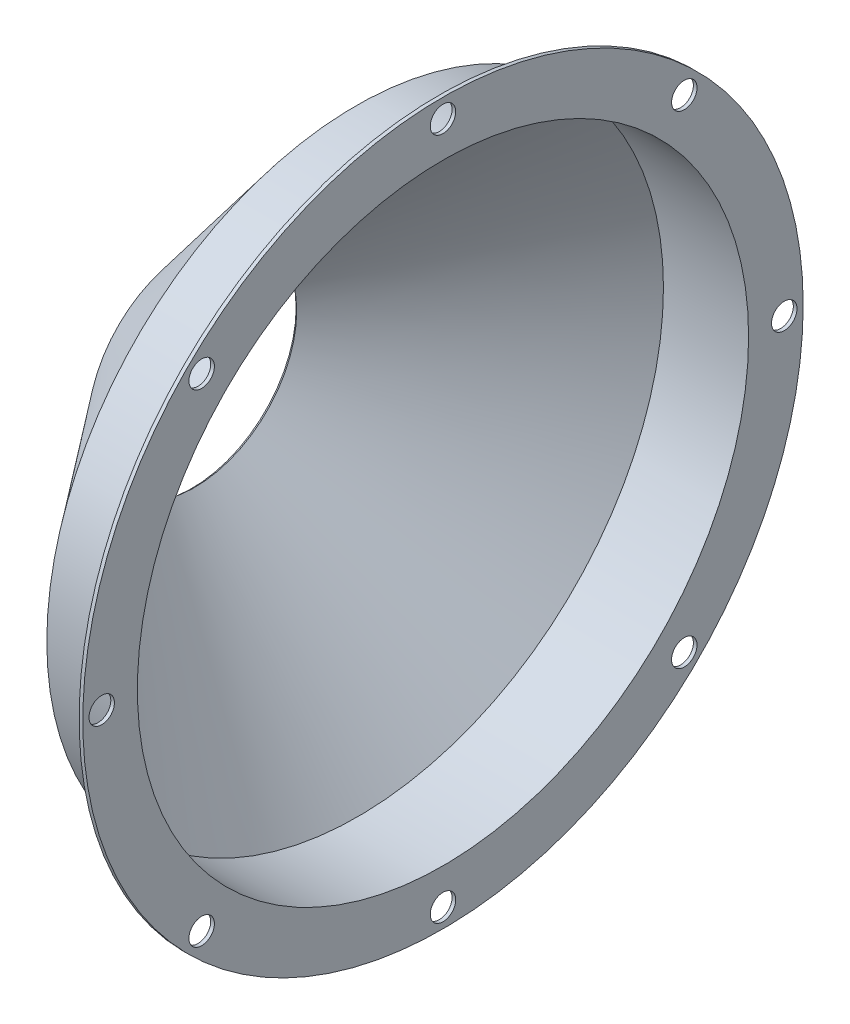
ISO-10303-21;
HEADER;
FILE_DESCRIPTION(('STEP AP214'),'2;1');
FILE_NAME('part.step','',(''),(''),'','','');
FILE_SCHEMA(('AUTOMOTIVE_DESIGN { 1 0 10303 214 1 1 1 1 }'));
ENDSEC;
DATA;
#1=APPLICATION_CONTEXT('core data for automotive mechanical design processes');
#2=APPLICATION_PROTOCOL_DEFINITION('international standard','automotive_design',2000,#1);
#3=PRODUCT_CONTEXT('',#1,'mechanical');
#4=PRODUCT('Part','Part','',(#3));
#5=PRODUCT_RELATED_PRODUCT_CATEGORY('part','',(#4));
#6=PRODUCT_DEFINITION_FORMATION('','',#4);
#7=PRODUCT_DEFINITION_CONTEXT('part definition',#1,'design');
#8=PRODUCT_DEFINITION('design','',#6,#7);
#9=PRODUCT_DEFINITION_SHAPE('','',#8);
#10=(LENGTH_UNIT() NAMED_UNIT(*) SI_UNIT(.MILLI.,.METRE.));
#11=(NAMED_UNIT(*) PLANE_ANGLE_UNIT() SI_UNIT($,.RADIAN.));
#12=(NAMED_UNIT(*) SI_UNIT($,.STERADIAN.) SOLID_ANGLE_UNIT());
#13=UNCERTAINTY_MEASURE_WITH_UNIT(LENGTH_MEASURE(1.E-05),#10,'distance_accuracy_value','');
#14=(GEOMETRIC_REPRESENTATION_CONTEXT(3) GLOBAL_UNCERTAINTY_ASSIGNED_CONTEXT((#13)) GLOBAL_UNIT_ASSIGNED_CONTEXT((#10,
#11,#12)) REPRESENTATION_CONTEXT('',''));
#15=CARTESIAN_POINT('',(0.,0.,0.));
#16=DIRECTION('',(0.,0.,1.));
#17=DIRECTION('',(1.,0.,0.));
#18=AXIS2_PLACEMENT_3D('',#15,#16,#17);
#19=CARTESIAN_POINT('',(-1101.92494625838,0.,0.));
#20=DIRECTION('',(-1.,0.,0.));
#21=DIRECTION('',(0.,0.,1.));
#22=AXIS2_PLACEMENT_3D('',#19,#20,#21);
#23=CONICAL_SURFACE('',#22,25.9696344260629,0.674740942224053);
#24=CARTESIAN_POINT('',(-1101.21290322581,0.,0.));
#25=DIRECTION('',(1.,0.,0.));
#26=DIRECTION('',(0.,0.,-1.));
#27=AXIS2_PLACEMENT_3D('',#24,#25,#26);
#28=CIRCLE('',#27,25.3999999999994);
#29=CARTESIAN_POINT('',(-1101.21290322581,0.,-25.3999999999994));
#30=VERTEX_POINT('',#29);
#31=EDGE_CURVE('E10',#30,#30,#28,.T.);
#32=ORIENTED_EDGE('',*,*,#31,.T.);
#33=EDGE_LOOP('',(#32));
#34=FACE_BOUND('',#33,.T.);
#35=CARTESIAN_POINT('',(-1101.92494625838,0.,0.));
#36=DIRECTION('',(1.,0.,0.));
#37=DIRECTION('',(0.,0.,-1.));
#38=AXIS2_PLACEMENT_3D('',#35,#36,#37);
#39=CIRCLE('',#38,25.9696344260629);
#40=CARTESIAN_POINT('',(-1101.92494625838,0.,-25.9696344260629));
#41=VERTEX_POINT('',#40);
#42=EDGE_CURVE('E63',#41,#41,#39,.T.);
#43=ORIENTED_EDGE('',*,*,#42,.F.);
#44=EDGE_LOOP('',(#43));
#45=FACE_BOUND('',#44,.T.);
#46=ADVANCED_FACE('F35',(#34,#45),#23,.F.);
#47=CARTESIAN_POINT('',(-1101.21290322581,0.,0.));
#48=DIRECTION('',(1.,0.,0.));
#49=DIRECTION('',(0.,0.,-1.));
#50=AXIS2_PLACEMENT_3D('',#47,#48,#49);
#51=CONICAL_SURFACE('',#50,25.3999999999994,0.896055384571349);
#52=CARTESIAN_POINT('',(-1060.57290322581,0.,0.));
#53=DIRECTION('',(1.,0.,0.));
#54=DIRECTION('',(0.,0.,-1.));
#55=AXIS2_PLACEMENT_3D('',#52,#53,#54);
#56=CIRCLE('',#55,76.2);
#57=CARTESIAN_POINT('',(-1060.57290322581,0.,-76.2));
#58=VERTEX_POINT('',#57);
#59=EDGE_CURVE('E41',#58,#58,#56,.T.);
#60=ORIENTED_EDGE('',*,*,#59,.T.);
#61=EDGE_LOOP('',(#60));
#62=FACE_BOUND('',#61,.T.);
#63=ORIENTED_EDGE('',*,*,#31,.F.);
#64=EDGE_LOOP('',(#63));
#65=FACE_BOUND('',#64,.T.);
#66=ADVANCED_FACE('F150',(#62,#65),#51,.F.);
#67=CARTESIAN_POINT('',(0.,0.,0.));
#68=DIRECTION('',(1.,0.,0.));
#69=DIRECTION('',(0.,0.,-1.));
#70=AXIS2_PLACEMENT_3D('',#67,#68,#69);
#71=CYLINDRICAL_SURFACE('',#70,76.2);
#72=CARTESIAN_POINT('',(-1039.34104322581,0.,0.));
#73=DIRECTION('',(1.,0.,0.));
#74=DIRECTION('',(0.,0.,-1.));
#75=AXIS2_PLACEMENT_3D('',#72,#73,#74);
#76=CIRCLE('',#75,76.2);
#77=CARTESIAN_POINT('',(-1039.34104322581,0.,-76.2));
#78=VERTEX_POINT('',#77);
#79=EDGE_CURVE('E45',#78,#78,#76,.T.);
#80=ORIENTED_EDGE('',*,*,#79,.T.);
#81=EDGE_LOOP('',(#80));
#82=FACE_BOUND('',#81,.T.);
#83=ORIENTED_EDGE('',*,*,#59,.F.);
#84=EDGE_LOOP('',(#83));
#85=FACE_BOUND('',#84,.T.);
#86=ADVANCED_FACE('F143',(#82,#85),#71,.F.);
#87=CARTESIAN_POINT('',(-1039.34104322581,89.81186,0.));
#88=DIRECTION('',(1.,0.,0.));
#89=DIRECTION('',(0.,0.,-1.));
#90=AXIS2_PLACEMENT_3D('',#87,#88,#89);
#91=PLANE('',#90);
#92=CARTESIAN_POINT('',(-1039.34104322581,-2.97090147122162E-13,85.09));
#93=DIRECTION('',(1.,0.,0.));
#94=DIRECTION('',(0.,0.,-1.));
#95=AXIS2_PLACEMENT_3D('',#92,#93,#94);
#96=CIRCLE('',#95,3.175);
#97=CARTESIAN_POINT('',(-1039.34104322581,-2.97090147122162E-13,81.915));
#98=VERTEX_POINT('',#97);
#99=EDGE_CURVE('E78',#98,#98,#96,.F.);
#100=ORIENTED_EDGE('',*,*,#99,.T.);
#101=EDGE_LOOP('',(#100));
#102=FACE_BOUND('',#101,.T.);
#103=CARTESIAN_POINT('',(-1039.34104322581,-60.1677160111636,60.167716011163));
#104=DIRECTION('',(1.,0.,0.));
#105=DIRECTION('',(0.,0.,-1.));
#106=AXIS2_PLACEMENT_3D('',#103,#104,#105);
#107=CIRCLE('',#106,3.175);
#108=CARTESIAN_POINT('',(-1039.34104322581,-60.1677160111636,56.992716011163));
#109=VERTEX_POINT('',#108);
#110=EDGE_CURVE('E93',#109,#109,#107,.F.);
#111=ORIENTED_EDGE('',*,*,#110,.T.);
#112=EDGE_LOOP('',(#111));
#113=FACE_BOUND('',#112,.T.);
#114=CARTESIAN_POINT('',(-1039.34104322581,-85.09,0.));
#115=DIRECTION('',(1.,0.,0.));
#116=DIRECTION('',(0.,0.,-1.));
#117=AXIS2_PLACEMENT_3D('',#114,#115,#116);
#118=CIRCLE('',#117,3.175);
#119=CARTESIAN_POINT('',(-1039.34104322581,-85.09,-3.175));
#120=VERTEX_POINT('',#119);
#121=EDGE_CURVE('E87',#120,#120,#118,.F.);
#122=ORIENTED_EDGE('',*,*,#121,.T.);
#123=EDGE_LOOP('',(#122));
#124=FACE_BOUND('',#123,.T.);
#125=CARTESIAN_POINT('',(-1039.34104322581,-60.1677160111628,-60.1677160111638));
#126=DIRECTION('',(1.,0.,0.));
#127=DIRECTION('',(0.,0.,-1.));
#128=AXIS2_PLACEMENT_3D('',#125,#126,#127);
#129=CIRCLE('',#128,3.175);
#130=CARTESIAN_POINT('',(-1039.34104322581,-60.1677160111628,-63.3427160111638));
#131=VERTEX_POINT('',#130);
#132=EDGE_CURVE('E79',#131,#131,#129,.F.);
#133=ORIENTED_EDGE('',*,*,#132,.T.);
#134=EDGE_LOOP('',(#133));
#135=FACE_BOUND('',#134,.T.);
#136=CARTESIAN_POINT('',(-1039.34104322581,8.91270441366487E-13,-85.09));
#137=DIRECTION('',(1.,0.,0.));
#138=DIRECTION('',(0.,0.,-1.));
#139=AXIS2_PLACEMENT_3D('',#136,#137,#138);
#140=CIRCLE('',#139,3.175);
#141=CARTESIAN_POINT('',(-1039.34104322581,8.91270441366487E-13,-88.265));
#142=VERTEX_POINT('',#141);
#143=EDGE_CURVE('E86',#142,#142,#140,.F.);
#144=ORIENTED_EDGE('',*,*,#143,.T.);
#145=EDGE_LOOP('',(#144));
#146=FACE_BOUND('',#145,.T.);
#147=CARTESIAN_POINT('',(-1039.34104322581,60.1677160111641,-60.1677160111626));
#148=DIRECTION('',(1.,0.,0.));
#149=DIRECTION('',(0.,0.,-1.));
#150=AXIS2_PLACEMENT_3D('',#147,#148,#149);
#151=CIRCLE('',#150,3.175);
#152=CARTESIAN_POINT('',(-1039.34104322581,60.1677160111641,-63.3427160111626));
#153=VERTEX_POINT('',#152);
#154=EDGE_CURVE('E103',#153,#153,#151,.F.);
#155=ORIENTED_EDGE('',*,*,#154,.T.);
#156=EDGE_LOOP('',(#155));
#157=FACE_BOUND('',#156,.T.);
#158=CARTESIAN_POINT('',(-1039.34104322581,60.1677160111632,60.1677160111634));
#159=DIRECTION('',(1.,0.,0.));
#160=DIRECTION('',(0.,0.,-1.));
#161=AXIS2_PLACEMENT_3D('',#158,#159,#160);
#162=CIRCLE('',#161,3.175);
#163=CARTESIAN_POINT('',(-1039.34104322581,60.1677160111632,56.9927160111634));
#164=VERTEX_POINT('',#163);
#165=EDGE_CURVE('E72',#164,#164,#162,.F.);
#166=ORIENTED_EDGE('',*,*,#165,.T.);
#167=EDGE_LOOP('',(#166));
#168=FACE_BOUND('',#167,.T.);
#169=CARTESIAN_POINT('',(-1039.34104322581,85.09,0.));
#170=DIRECTION('',(1.,0.,0.));
#171=DIRECTION('',(0.,0.,-1.));
#172=AXIS2_PLACEMENT_3D('',#169,#170,#171);
#173=CIRCLE('',#172,3.175);
#174=CARTESIAN_POINT('',(-1039.34104322581,85.09,-3.175));
#175=VERTEX_POINT('',#174);
#176=EDGE_CURVE('E66',#175,#175,#173,.F.);
#177=ORIENTED_EDGE('',*,*,#176,.T.);
#178=EDGE_LOOP('',(#177));
#179=FACE_BOUND('',#178,.T.);
#180=CARTESIAN_POINT('',(-1039.34104322581,0.,0.));
#181=DIRECTION('',(1.,0.,0.));
#182=DIRECTION('',(0.,0.,-1.));
#183=AXIS2_PLACEMENT_3D('',#180,#181,#182);
#184=CIRCLE('',#183,89.81186);
#185=CARTESIAN_POINT('',(-1039.34104322581,0.,-89.81186));
#186=VERTEX_POINT('',#185);
#187=EDGE_CURVE('E49',#186,#186,#184,.T.);
#188=ORIENTED_EDGE('',*,*,#187,.T.);
#189=EDGE_LOOP('',(#188));
#190=FACE_BOUND('',#189,.T.);
#191=ORIENTED_EDGE('',*,*,#79,.F.);
#192=EDGE_LOOP('',(#191));
#193=FACE_BOUND('',#192,.T.);
#194=ADVANCED_FACE('F137',(#102,#113,#124,#135,#146,#157,#168,#179,#190,#193),#91,.T.);
#195=CARTESIAN_POINT('',(0.,0.,0.));
#196=DIRECTION('',(1.,0.,0.));
#197=DIRECTION('',(0.,0.,-1.));
#198=AXIS2_PLACEMENT_3D('',#195,#196,#197);
#199=CYLINDRICAL_SURFACE('',#198,89.81186);
#200=CARTESIAN_POINT('',(-1040.25290322581,0.,0.));
#201=DIRECTION('',(1.,0.,0.));
#202=DIRECTION('',(0.,0.,-1.));
#203=AXIS2_PLACEMENT_3D('',#200,#201,#202);
#204=CIRCLE('',#203,89.81186);
#205=CARTESIAN_POINT('',(-1040.25290322581,0.,-89.81186));
#206=VERTEX_POINT('',#205);
#207=EDGE_CURVE('E54',#206,#206,#204,.T.);
#208=ORIENTED_EDGE('',*,*,#207,.T.);
#209=EDGE_LOOP('',(#208));
#210=FACE_BOUND('',#209,.T.);
#211=ORIENTED_EDGE('',*,*,#187,.F.);
#212=EDGE_LOOP('',(#211));
#213=FACE_BOUND('',#212,.T.);
#214=ADVANCED_FACE('F122',(#210,#213),#199,.T.);
#215=CARTESIAN_POINT('',(-1040.25290322581,77.11186,0.));
#216=DIRECTION('',(-1.,0.,0.));
#217=DIRECTION('',(0.,0.,1.));
#218=AXIS2_PLACEMENT_3D('',#215,#216,#217);
#219=PLANE('',#218);
#220=CARTESIAN_POINT('',(-1040.25290322581,-2.97090147122162E-13,85.09));
#221=DIRECTION('',(-1.,0.,0.));
#222=DIRECTION('',(0.,0.,1.));
#223=AXIS2_PLACEMENT_3D('',#220,#221,#222);
#224=CIRCLE('',#223,3.175);
#225=CARTESIAN_POINT('',(-1040.25290322581,-2.97090147122162E-13,88.265));
#226=VERTEX_POINT('',#225);
#227=EDGE_CURVE('E96',#226,#226,#224,.T.);
#228=ORIENTED_EDGE('',*,*,#227,.F.);
#229=EDGE_LOOP('',(#228));
#230=FACE_BOUND('',#229,.T.);
#231=CARTESIAN_POINT('',(-1040.25290322581,-60.1677160111636,60.167716011163));
#232=DIRECTION('',(-1.,0.,0.));
#233=DIRECTION('',(0.,0.,1.));
#234=AXIS2_PLACEMENT_3D('',#231,#232,#233);
#235=CIRCLE('',#234,3.175);
#236=CARTESIAN_POINT('',(-1040.25290322581,-60.1677160111636,63.342716011163));
#237=VERTEX_POINT('',#236);
#238=EDGE_CURVE('E90',#237,#237,#235,.T.);
#239=ORIENTED_EDGE('',*,*,#238,.F.);
#240=EDGE_LOOP('',(#239));
#241=FACE_BOUND('',#240,.T.);
#242=CARTESIAN_POINT('',(-1040.25290322581,-85.09,0.));
#243=DIRECTION('',(-1.,0.,0.));
#244=DIRECTION('',(0.,0.,1.));
#245=AXIS2_PLACEMENT_3D('',#242,#243,#244);
#246=CIRCLE('',#245,3.175);
#247=CARTESIAN_POINT('',(-1040.25290322581,-85.09,3.175));
#248=VERTEX_POINT('',#247);
#249=EDGE_CURVE('E82',#248,#248,#246,.T.);
#250=ORIENTED_EDGE('',*,*,#249,.F.);
#251=EDGE_LOOP('',(#250));
#252=FACE_BOUND('',#251,.T.);
#253=CARTESIAN_POINT('',(-1040.25290322581,-60.1677160111628,-60.1677160111638));
#254=DIRECTION('',(-1.,0.,0.));
#255=DIRECTION('',(0.,0.,1.));
#256=AXIS2_PLACEMENT_3D('',#253,#254,#255);
#257=CIRCLE('',#256,3.175);
#258=CARTESIAN_POINT('',(-1040.25290322581,-60.1677160111628,-56.9927160111638));
#259=VERTEX_POINT('',#258);
#260=EDGE_CURVE('E83',#259,#259,#257,.T.);
#261=ORIENTED_EDGE('',*,*,#260,.F.);
#262=EDGE_LOOP('',(#261));
#263=FACE_BOUND('',#262,.T.);
#264=CARTESIAN_POINT('',(-1040.25290322581,8.91270441366487E-13,-85.09));
#265=DIRECTION('',(-1.,0.,0.));
#266=DIRECTION('',(0.,0.,1.));
#267=AXIS2_PLACEMENT_3D('',#264,#265,#266);
#268=CIRCLE('',#267,3.175);
#269=CARTESIAN_POINT('',(-1040.25290322581,8.91270441366487E-13,-81.915));
#270=VERTEX_POINT('',#269);
#271=EDGE_CURVE('E106',#270,#270,#268,.T.);
#272=ORIENTED_EDGE('',*,*,#271,.F.);
#273=EDGE_LOOP('',(#272));
#274=FACE_BOUND('',#273,.T.);
#275=CARTESIAN_POINT('',(-1040.25290322581,60.1677160111641,-60.1677160111626));
#276=DIRECTION('',(-1.,0.,0.));
#277=DIRECTION('',(0.,0.,1.));
#278=AXIS2_PLACEMENT_3D('',#275,#276,#277);
#279=CIRCLE('',#278,3.175);
#280=CARTESIAN_POINT('',(-1040.25290322581,60.1677160111641,-56.9927160111626));
#281=VERTEX_POINT('',#280);
#282=EDGE_CURVE('E107',#281,#281,#279,.T.);
#283=ORIENTED_EDGE('',*,*,#282,.F.);
#284=EDGE_LOOP('',(#283));
#285=FACE_BOUND('',#284,.T.);
#286=CARTESIAN_POINT('',(-1040.25290322581,60.1677160111632,60.1677160111634));
#287=DIRECTION('',(-1.,0.,0.));
#288=DIRECTION('',(0.,0.,1.));
#289=AXIS2_PLACEMENT_3D('',#286,#287,#288);
#290=CIRCLE('',#289,3.175);
#291=CARTESIAN_POINT('',(-1040.25290322581,60.1677160111632,63.3427160111634));
#292=VERTEX_POINT('',#291);
#293=EDGE_CURVE('E75',#292,#292,#290,.T.);
#294=ORIENTED_EDGE('',*,*,#293,.F.);
#295=EDGE_LOOP('',(#294));
#296=FACE_BOUND('',#295,.T.);
#297=CARTESIAN_POINT('',(-1040.25290322581,85.09,0.));
#298=DIRECTION('',(-1.,0.,0.));
#299=DIRECTION('',(0.,0.,1.));
#300=AXIS2_PLACEMENT_3D('',#297,#298,#299);
#301=CIRCLE('',#300,3.175);
#302=CARTESIAN_POINT('',(-1040.25290322581,85.09,3.175));
#303=VERTEX_POINT('',#302);
#304=EDGE_CURVE('E69',#303,#303,#301,.T.);
#305=ORIENTED_EDGE('',*,*,#304,.F.);
#306=EDGE_LOOP('',(#305));
#307=FACE_BOUND('',#306,.T.);
#308=CARTESIAN_POINT('',(-1040.25290322581,0.,0.));
#309=DIRECTION('',(1.,0.,0.));
#310=DIRECTION('',(0.,0.,-1.));
#311=AXIS2_PLACEMENT_3D('',#308,#309,#310);
#312=CIRCLE('',#311,77.11186);
#313=CARTESIAN_POINT('',(-1040.25290322581,0.,-77.11186));
#314=VERTEX_POINT('',#313);
#315=EDGE_CURVE('E57',#314,#314,#312,.T.);
#316=ORIENTED_EDGE('',*,*,#315,.T.);
#317=EDGE_LOOP('',(#316));
#318=FACE_BOUND('',#317,.T.);
#319=ORIENTED_EDGE('',*,*,#207,.F.);
#320=EDGE_LOOP('',(#319));
#321=FACE_BOUND('',#320,.T.);
#322=ADVANCED_FACE('F118',(#230,#241,#252,#263,#274,#285,#296,#307,#318,#321),#219,.T.);
#323=CARTESIAN_POINT('',(0.,0.,0.));
#324=DIRECTION('',(1.,0.,0.));
#325=DIRECTION('',(0.,0.,-1.));
#326=AXIS2_PLACEMENT_3D('',#323,#324,#325);
#327=CYLINDRICAL_SURFACE('',#326,77.11186);
#328=CARTESIAN_POINT('',(-1061.01116579924,0.,0.));
#329=DIRECTION('',(1.,0.,0.));
#330=DIRECTION('',(0.,0.,-1.));
#331=AXIS2_PLACEMENT_3D('',#328,#329,#330);
#332=CIRCLE('',#331,77.11186);
#333=CARTESIAN_POINT('',(-1061.01116579924,0.,-77.11186));
#334=VERTEX_POINT('',#333);
#335=EDGE_CURVE('E60',#334,#334,#332,.T.);
#336=ORIENTED_EDGE('',*,*,#335,.T.);
#337=EDGE_LOOP('',(#336));
#338=FACE_BOUND('',#337,.T.);
#339=ORIENTED_EDGE('',*,*,#315,.F.);
#340=EDGE_LOOP('',(#339));
#341=FACE_BOUND('',#340,.T.);
#342=ADVANCED_FACE('F121',(#338,#341),#327,.T.);
#343=CARTESIAN_POINT('',(-1061.01116579924,0.,0.));
#344=DIRECTION('',(1.,0.,0.));
#345=DIRECTION('',(0.,0.,-1.));
#346=AXIS2_PLACEMENT_3D('',#343,#344,#345);
#347=CONICAL_SURFACE('',#346,77.11186,0.896055384571343);
#348=ORIENTED_EDGE('',*,*,#42,.T.);
#349=EDGE_LOOP('',(#348));
#350=FACE_BOUND('',#349,.T.);
#351=ORIENTED_EDGE('',*,*,#335,.F.);
#352=EDGE_LOOP('',(#351));
#353=FACE_BOUND('',#352,.T.);
#354=ADVANCED_FACE('F161',(#350,#353),#347,.T.);
#355=CARTESIAN_POINT('',(-1030.36078710474,85.09,0.));
#356=DIRECTION('',(-1.,0.,0.));
#357=DIRECTION('',(0.,0.,1.));
#358=AXIS2_PLACEMENT_3D('',#355,#356,#357);
#359=CYLINDRICAL_SURFACE('',#358,3.175);
#360=ORIENTED_EDGE('',*,*,#304,.T.);
#361=EDGE_LOOP('',(#360));
#362=FACE_BOUND('',#361,.T.);
#363=ORIENTED_EDGE('',*,*,#176,.F.);
#364=EDGE_LOOP('',(#363));
#365=FACE_BOUND('',#364,.T.);
#366=ADVANCED_FACE('F164',(#362,#365),#359,.F.);
#367=CARTESIAN_POINT('',(-1030.36078710474,60.1677160111632,60.1677160111634));
#368=DIRECTION('',(-1.,0.,0.));
#369=DIRECTION('',(0.,0.,1.));
#370=AXIS2_PLACEMENT_3D('',#367,#368,#369);
#371=CYLINDRICAL_SURFACE('',#370,3.175);
#372=ORIENTED_EDGE('',*,*,#293,.T.);
#373=EDGE_LOOP('',(#372));
#374=FACE_BOUND('',#373,.T.);
#375=ORIENTED_EDGE('',*,*,#165,.F.);
#376=EDGE_LOOP('',(#375));
#377=FACE_BOUND('',#376,.T.);
#378=ADVANCED_FACE('F176',(#374,#377),#371,.F.);
#379=CARTESIAN_POINT('',(-1030.36078710474,60.1677160111641,-60.1677160111626));
#380=DIRECTION('',(-1.,0.,0.));
#381=DIRECTION('',(0.,0.,1.));
#382=AXIS2_PLACEMENT_3D('',#379,#380,#381);
#383=CYLINDRICAL_SURFACE('',#382,3.175);
#384=ORIENTED_EDGE('',*,*,#282,.T.);
#385=EDGE_LOOP('',(#384));
#386=FACE_BOUND('',#385,.T.);
#387=ORIENTED_EDGE('',*,*,#154,.F.);
#388=EDGE_LOOP('',(#387));
#389=FACE_BOUND('',#388,.T.);
#390=ADVANCED_FACE('F180',(#386,#389),#383,.F.);
#391=CARTESIAN_POINT('',(-1030.36078710474,8.91270441366487E-13,-85.09));
#392=DIRECTION('',(-1.,0.,0.));
#393=DIRECTION('',(0.,0.,1.));
#394=AXIS2_PLACEMENT_3D('',#391,#392,#393);
#395=CYLINDRICAL_SURFACE('',#394,3.175);
#396=ORIENTED_EDGE('',*,*,#271,.T.);
#397=EDGE_LOOP('',(#396));
#398=FACE_BOUND('',#397,.T.);
#399=ORIENTED_EDGE('',*,*,#143,.F.);
#400=EDGE_LOOP('',(#399));
#401=FACE_BOUND('',#400,.T.);
#402=ADVANCED_FACE('F115',(#398,#401),#395,.F.);
#403=CARTESIAN_POINT('',(-1030.36078710474,-60.1677160111628,-60.1677160111638));
#404=DIRECTION('',(-1.,0.,0.));
#405=DIRECTION('',(0.,0.,1.));
#406=AXIS2_PLACEMENT_3D('',#403,#404,#405);
#407=CYLINDRICAL_SURFACE('',#406,3.175);
#408=ORIENTED_EDGE('',*,*,#260,.T.);
#409=EDGE_LOOP('',(#408));
#410=FACE_BOUND('',#409,.T.);
#411=ORIENTED_EDGE('',*,*,#132,.F.);
#412=EDGE_LOOP('',(#411));
#413=FACE_BOUND('',#412,.T.);
#414=ADVANCED_FACE('F182',(#410,#413),#407,.F.);
#415=CARTESIAN_POINT('',(-1030.36078710474,-85.09,0.));
#416=DIRECTION('',(-1.,0.,0.));
#417=DIRECTION('',(0.,0.,1.));
#418=AXIS2_PLACEMENT_3D('',#415,#416,#417);
#419=CYLINDRICAL_SURFACE('',#418,3.175);
#420=ORIENTED_EDGE('',*,*,#249,.T.);
#421=EDGE_LOOP('',(#420));
#422=FACE_BOUND('',#421,.T.);
#423=ORIENTED_EDGE('',*,*,#121,.F.);
#424=EDGE_LOOP('',(#423));
#425=FACE_BOUND('',#424,.T.);
#426=ADVANCED_FACE('F185',(#422,#425),#419,.F.);
#427=CARTESIAN_POINT('',(-1030.36078710474,-60.1677160111636,60.167716011163));
#428=DIRECTION('',(-1.,0.,0.));
#429=DIRECTION('',(0.,0.,1.));
#430=AXIS2_PLACEMENT_3D('',#427,#428,#429);
#431=CYLINDRICAL_SURFACE('',#430,3.175);
#432=ORIENTED_EDGE('',*,*,#238,.T.);
#433=EDGE_LOOP('',(#432));
#434=FACE_BOUND('',#433,.T.);
#435=ORIENTED_EDGE('',*,*,#110,.F.);
#436=EDGE_LOOP('',(#435));
#437=FACE_BOUND('',#436,.T.);
#438=ADVANCED_FACE('F189',(#434,#437),#431,.F.);
#439=CARTESIAN_POINT('',(-1030.36078710474,-2.97090147122162E-13,85.09));
#440=DIRECTION('',(-1.,0.,0.));
#441=DIRECTION('',(0.,0.,1.));
#442=AXIS2_PLACEMENT_3D('',#439,#440,#441);
#443=CYLINDRICAL_SURFACE('',#442,3.175);
#444=ORIENTED_EDGE('',*,*,#227,.T.);
#445=EDGE_LOOP('',(#444));
#446=FACE_BOUND('',#445,.T.);
#447=ORIENTED_EDGE('',*,*,#99,.F.);
#448=EDGE_LOOP('',(#447));
#449=FACE_BOUND('',#448,.T.);
#450=ADVANCED_FACE('F193',(#446,#449),#443,.F.);
#451=CLOSED_SHELL('',(#46,#66,#86,#194,#214,#322,#342,#354,#366,#378,#390,#402,#414,#426,#438,#450));
#452=MANIFOLD_SOLID_BREP('B2',#451);
#453=ADVANCED_BREP_SHAPE_REPRESENTATION('',(#18,#452),#14);
#454=SHAPE_DEFINITION_REPRESENTATION(#9,#453);
ENDSEC;
END-ISO-10303-21;
